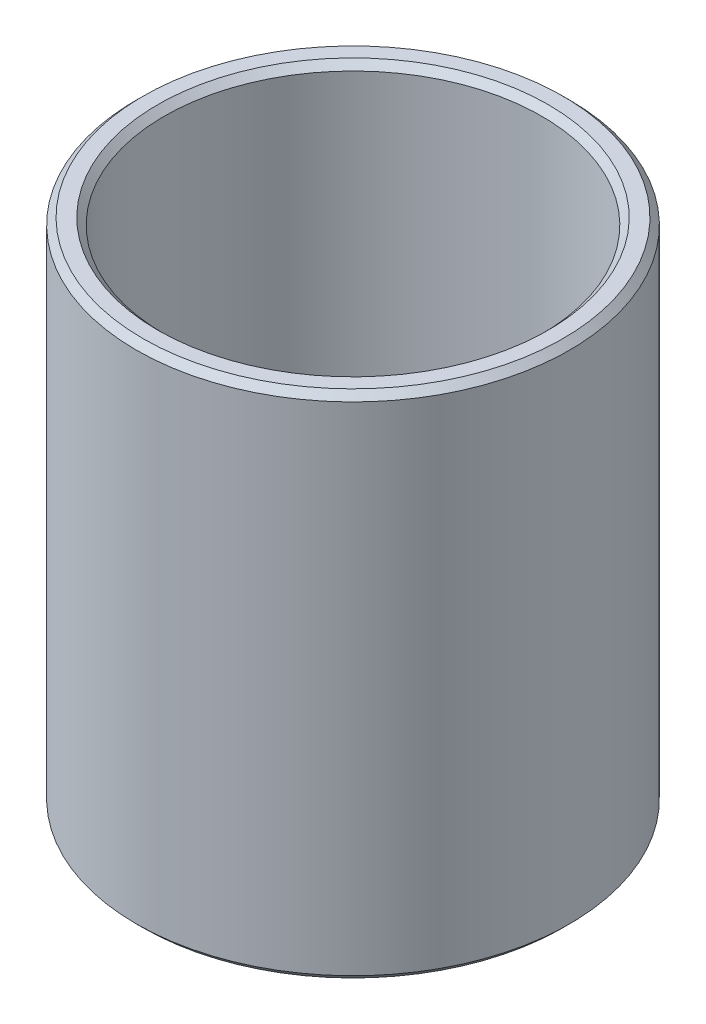
ISO-10303-21;
HEADER;
FILE_DESCRIPTION(('STEP AP214'),'2;1');
FILE_NAME('part.step','',(''),(''),'','','');
FILE_SCHEMA(('AUTOMOTIVE_DESIGN { 1 0 10303 214 1 1 1 1 }'));
ENDSEC;
DATA;
#1=APPLICATION_CONTEXT('core data for automotive mechanical design processes');
#2=APPLICATION_PROTOCOL_DEFINITION('international standard','automotive_design',2000,#1);
#3=PRODUCT_CONTEXT('',#1,'mechanical');
#4=PRODUCT('Part','Part','',(#3));
#5=PRODUCT_RELATED_PRODUCT_CATEGORY('part','',(#4));
#6=PRODUCT_DEFINITION_FORMATION('','',#4);
#7=PRODUCT_DEFINITION_CONTEXT('part definition',#1,'design');
#8=PRODUCT_DEFINITION('design','',#6,#7);
#9=PRODUCT_DEFINITION_SHAPE('','',#8);
#10=(LENGTH_UNIT() NAMED_UNIT(*) SI_UNIT(.MILLI.,.METRE.));
#11=(NAMED_UNIT(*) PLANE_ANGLE_UNIT() SI_UNIT($,.RADIAN.));
#12=(NAMED_UNIT(*) SI_UNIT($,.STERADIAN.) SOLID_ANGLE_UNIT());
#13=UNCERTAINTY_MEASURE_WITH_UNIT(LENGTH_MEASURE(1.E-05),#10,'distance_accuracy_value','');
#14=(GEOMETRIC_REPRESENTATION_CONTEXT(3) GLOBAL_UNCERTAINTY_ASSIGNED_CONTEXT((#13)) GLOBAL_UNIT_ASSIGNED_CONTEXT((#10,
#11,#12)) REPRESENTATION_CONTEXT('',''));
#15=CARTESIAN_POINT('',(0.,0.,0.));
#16=DIRECTION('',(0.,0.,1.));
#17=DIRECTION('',(1.,0.,0.));
#18=AXIS2_PLACEMENT_3D('',#15,#16,#17);
#19=CARTESIAN_POINT('',(0.,88.3166128470527,0.));
#20=DIRECTION('',(0.,-1.,0.));
#21=DIRECTION('',(0.,0.,-1.));
#22=AXIS2_PLACEMENT_3D('',#19,#20,#21);
#23=CYLINDRICAL_SURFACE('',#22,37.5);
#24=CARTESIAN_POINT('',(0.,1.14977486604857,0.));
#25=DIRECTION('',(0.,1.,0.));
#26=DIRECTION('',(0.,0.,1.));
#27=AXIS2_PLACEMENT_3D('',#24,#25,#26);
#28=CIRCLE('',#27,37.5);
#29=CARTESIAN_POINT('',(0.,1.14977486604857,37.5));
#30=VERTEX_POINT('',#29);
#31=EDGE_CURVE('E10',#30,#30,#28,.T.);
#32=ORIENTED_EDGE('',*,*,#31,.T.);
#33=EDGE_LOOP('',(#32));
#34=FACE_BOUND('',#33,.T.);
#35=CARTESIAN_POINT('',(0.,87.1668379810041,0.));
#36=DIRECTION('',(0.,1.,0.));
#37=DIRECTION('',(0.,0.,1.));
#38=AXIS2_PLACEMENT_3D('',#35,#36,#37);
#39=CIRCLE('',#38,37.5);
#40=CARTESIAN_POINT('',(0.,87.1668379810041,37.5));
#41=VERTEX_POINT('',#40);
#42=EDGE_CURVE('E50',#41,#41,#39,.F.);
#43=ORIENTED_EDGE('',*,*,#42,.T.);
#44=EDGE_LOOP('',(#43));
#45=FACE_BOUND('',#44,.T.);
#46=ADVANCED_FACE('F39',(#34,#45),#23,.T.);
#47=CARTESIAN_POINT('',(0.,88.3166128470527,0.));
#48=DIRECTION('',(0.,1.,0.));
#49=DIRECTION('',(0.,0.,1.));
#50=AXIS2_PLACEMENT_3D('',#47,#48,#49);
#51=PLANE('',#50);
#52=CARTESIAN_POINT('',(0.,88.3166128470527,0.));
#53=DIRECTION('',(0.,1.,0.));
#54=DIRECTION('',(0.,0.,1.));
#55=AXIS2_PLACEMENT_3D('',#52,#53,#54);
#56=CIRCLE('',#55,33.8104479683814);
#57=CARTESIAN_POINT('',(0.,88.3166128470527,33.8104479683814));
#58=VERTEX_POINT('',#57);
#59=EDGE_CURVE('E58',#58,#58,#56,.F.);
#60=ORIENTED_EDGE('',*,*,#59,.T.);
#61=EDGE_LOOP('',(#60));
#62=FACE_BOUND('',#61,.T.);
#63=CARTESIAN_POINT('',(0.,88.3166128470527,0.));
#64=DIRECTION('',(0.,1.,0.));
#65=DIRECTION('',(0.,0.,1.));
#66=AXIS2_PLACEMENT_3D('',#63,#64,#65);
#67=CIRCLE('',#66,36.3502251339514);
#68=CARTESIAN_POINT('',(0.,88.3166128470527,36.3502251339514));
#69=VERTEX_POINT('',#68);
#70=EDGE_CURVE('E61',#69,#69,#67,.T.);
#71=ORIENTED_EDGE('',*,*,#70,.T.);
#72=EDGE_LOOP('',(#71));
#73=FACE_BOUND('',#72,.T.);
#74=ADVANCED_FACE('F88',(#62,#73),#51,.T.);
#75=CARTESIAN_POINT('',(0.,0.,0.));
#76=DIRECTION('',(0.,1.,0.));
#77=DIRECTION('',(0.,0.,1.));
#78=AXIS2_PLACEMENT_3D('',#75,#76,#77);
#79=PLANE('',#78);
#80=CARTESIAN_POINT('',(0.,0.,0.));
#81=DIRECTION('',(0.,1.,0.));
#82=DIRECTION('',(0.,0.,1.));
#83=AXIS2_PLACEMENT_3D('',#80,#81,#82);
#84=CIRCLE('',#83,33.8104479683814);
#85=CARTESIAN_POINT('',(0.,0.,33.8104479683814));
#86=VERTEX_POINT('',#85);
#87=EDGE_CURVE('E51',#86,#86,#84,.T.);
#88=ORIENTED_EDGE('',*,*,#87,.T.);
#89=EDGE_LOOP('',(#88));
#90=FACE_BOUND('',#89,.T.);
#91=CARTESIAN_POINT('',(0.,0.,0.));
#92=DIRECTION('',(0.,1.,0.));
#93=DIRECTION('',(0.,0.,1.));
#94=AXIS2_PLACEMENT_3D('',#91,#92,#93);
#95=CIRCLE('',#94,36.3502251339514);
#96=CARTESIAN_POINT('',(0.,0.,36.3502251339514));
#97=VERTEX_POINT('',#96);
#98=EDGE_CURVE('E54',#97,#97,#95,.F.);
#99=ORIENTED_EDGE('',*,*,#98,.T.);
#100=EDGE_LOOP('',(#99));
#101=FACE_BOUND('',#100,.T.);
#102=ADVANCED_FACE('F83',(#90,#101),#79,.F.);
#103=CARTESIAN_POINT('',(0.,88.3166128470527,0.));
#104=DIRECTION('',(0.,-1.,0.));
#105=DIRECTION('',(0.,0.,-1.));
#106=AXIS2_PLACEMENT_3D('',#103,#104,#105);
#107=CYLINDRICAL_SURFACE('',#106,32.6606731023329);
#108=CARTESIAN_POINT('',(0.,87.1668379810042,0.));
#109=DIRECTION('',(0.,1.,0.));
#110=DIRECTION('',(0.,0.,1.));
#111=AXIS2_PLACEMENT_3D('',#108,#109,#110);
#112=CIRCLE('',#111,32.6606731023329);
#113=CARTESIAN_POINT('',(0.,87.1668379810042,32.6606731023329));
#114=VERTEX_POINT('',#113);
#115=EDGE_CURVE('E67',#114,#114,#112,.T.);
#116=ORIENTED_EDGE('',*,*,#115,.T.);
#117=EDGE_LOOP('',(#116));
#118=FACE_BOUND('',#117,.T.);
#119=CARTESIAN_POINT('',(0.,1.14977486604859,0.));
#120=DIRECTION('',(0.,1.,0.));
#121=DIRECTION('',(0.,0.,1.));
#122=AXIS2_PLACEMENT_3D('',#119,#120,#121);
#123=CIRCLE('',#122,32.6606731023329);
#124=CARTESIAN_POINT('',(0.,1.14977486604859,32.6606731023329));
#125=VERTEX_POINT('',#124);
#126=EDGE_CURVE('E69',#125,#125,#123,.F.);
#127=ORIENTED_EDGE('',*,*,#126,.T.);
#128=EDGE_LOOP('',(#127));
#129=FACE_BOUND('',#128,.T.);
#130=ADVANCED_FACE('F71',(#118,#129),#107,.F.);
#131=CARTESIAN_POINT('',(0.,87.1668379810042,0.));
#132=DIRECTION('',(0.,1.,0.));
#133=DIRECTION('',(0.,0.,1.));
#134=AXIS2_PLACEMENT_3D('',#131,#132,#133);
#135=CONICAL_SURFACE('',#134,32.6606731023329,0.785398163397448);
#136=ORIENTED_EDGE('',*,*,#59,.F.);
#137=EDGE_LOOP('',(#136));
#138=FACE_BOUND('',#137,.T.);
#139=ORIENTED_EDGE('',*,*,#115,.F.);
#140=EDGE_LOOP('',(#139));
#141=FACE_BOUND('',#140,.T.);
#142=ADVANCED_FACE('F77',(#138,#141),#135,.F.);
#143=CARTESIAN_POINT('',(0.,0.,0.));
#144=DIRECTION('',(0.,-1.,0.));
#145=DIRECTION('',(0.,0.,-1.));
#146=AXIS2_PLACEMENT_3D('',#143,#144,#145);
#147=CONICAL_SURFACE('',#146,33.8104479683814,0.785398163397442);
#148=ORIENTED_EDGE('',*,*,#126,.F.);
#149=EDGE_LOOP('',(#148));
#150=FACE_BOUND('',#149,.T.);
#151=ORIENTED_EDGE('',*,*,#87,.F.);
#152=EDGE_LOOP('',(#151));
#153=FACE_BOUND('',#152,.T.);
#154=ADVANCED_FACE('F73',(#150,#153),#147,.F.);
#155=CARTESIAN_POINT('',(0.,1.14977486604857,0.));
#156=DIRECTION('',(0.,1.,0.));
#157=DIRECTION('',(0.,0.,1.));
#158=AXIS2_PLACEMENT_3D('',#155,#156,#157);
#159=CONICAL_SURFACE('',#158,37.5,0.785398163397451);
#160=ORIENTED_EDGE('',*,*,#98,.F.);
#161=EDGE_LOOP('',(#160));
#162=FACE_BOUND('',#161,.T.);
#163=ORIENTED_EDGE('',*,*,#31,.F.);
#164=EDGE_LOOP('',(#163));
#165=FACE_BOUND('',#164,.T.);
#166=ADVANCED_FACE('F76',(#162,#165),#159,.T.);
#167=CARTESIAN_POINT('',(0.,88.3166128470527,0.));
#168=DIRECTION('',(0.,-1.,0.));
#169=DIRECTION('',(0.,0.,-1.));
#170=AXIS2_PLACEMENT_3D('',#167,#168,#169);
#171=CONICAL_SURFACE('',#170,36.3502251339514,0.785398163397442);
#172=ORIENTED_EDGE('',*,*,#42,.F.);
#173=EDGE_LOOP('',(#172));
#174=FACE_BOUND('',#173,.T.);
#175=ORIENTED_EDGE('',*,*,#70,.F.);
#176=EDGE_LOOP('',(#175));
#177=FACE_BOUND('',#176,.T.);
#178=ADVANCED_FACE('F45',(#174,#177),#171,.T.);
#179=CLOSED_SHELL('',(#46,#74,#102,#130,#142,#154,#166,#178));
#180=MANIFOLD_SOLID_BREP('B2',#179);
#181=ADVANCED_BREP_SHAPE_REPRESENTATION('',(#18,#180),#14);
#182=SHAPE_DEFINITION_REPRESENTATION(#9,#181);
ENDSEC;
END-ISO-10303-21;
